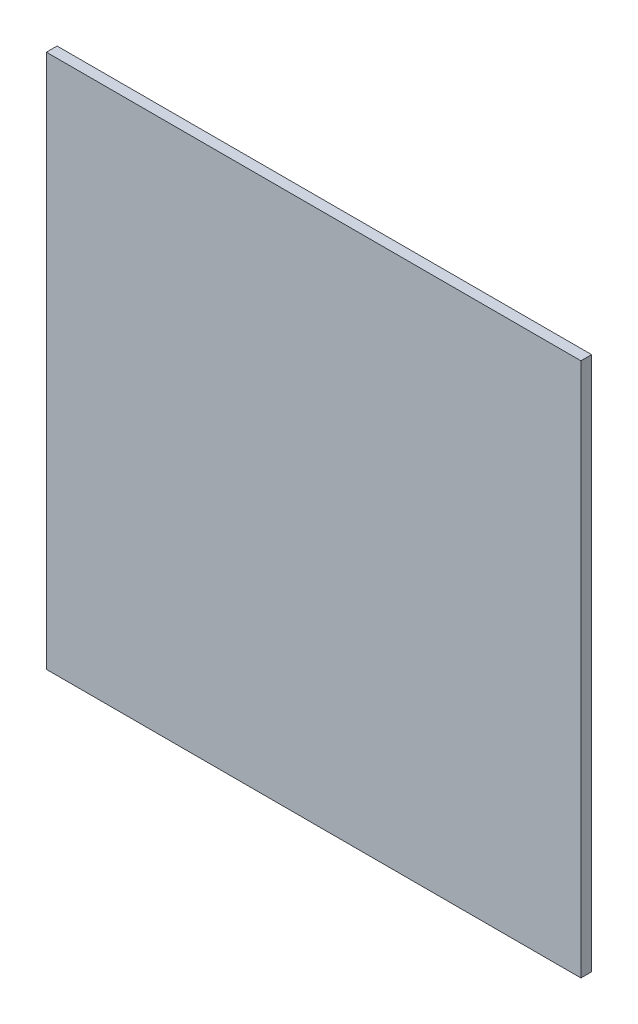
ISO-10303-21;
HEADER;
FILE_DESCRIPTION(('STEP AP214'),'2;1');
FILE_NAME('part.step','',(''),(''),'','','');
FILE_SCHEMA(('AUTOMOTIVE_DESIGN { 1 0 10303 214 1 1 1 1 }'));
ENDSEC;
DATA;
#1=APPLICATION_CONTEXT('core data for automotive mechanical design processes');
#2=APPLICATION_PROTOCOL_DEFINITION('international standard','automotive_design',2000,#1);
#3=PRODUCT_CONTEXT('',#1,'mechanical');
#4=PRODUCT('Part','Part','',(#3));
#5=PRODUCT_RELATED_PRODUCT_CATEGORY('part','',(#4));
#6=PRODUCT_DEFINITION_FORMATION('','',#4);
#7=PRODUCT_DEFINITION_CONTEXT('part definition',#1,'design');
#8=PRODUCT_DEFINITION('design','',#6,#7);
#9=PRODUCT_DEFINITION_SHAPE('','',#8);
#10=(LENGTH_UNIT() NAMED_UNIT(*) SI_UNIT(.MILLI.,.METRE.));
#11=(NAMED_UNIT(*) PLANE_ANGLE_UNIT() SI_UNIT($,.RADIAN.));
#12=(NAMED_UNIT(*) SI_UNIT($,.STERADIAN.) SOLID_ANGLE_UNIT());
#13=UNCERTAINTY_MEASURE_WITH_UNIT(LENGTH_MEASURE(1.E-05),#10,'distance_accuracy_value','');
#14=(GEOMETRIC_REPRESENTATION_CONTEXT(3) GLOBAL_UNCERTAINTY_ASSIGNED_CONTEXT((#13)) GLOBAL_UNIT_ASSIGNED_CONTEXT((#10,
#11,#12)) REPRESENTATION_CONTEXT('',''));
#15=CARTESIAN_POINT('',(0.,0.,0.));
#16=DIRECTION('',(0.,0.,1.));
#17=DIRECTION('',(1.,0.,0.));
#18=AXIS2_PLACEMENT_3D('',#15,#16,#17);
#19=CARTESIAN_POINT('',(0.,0.,1.));
#20=DIRECTION('',(1.,0.,0.));
#21=DIRECTION('',(0.,0.,-1.));
#22=AXIS2_PLACEMENT_3D('',#19,#20,#21);
#23=PLANE('',#22);
#24=DIRECTION('',(0.,-1.,0.));
#25=VECTOR('',#24,1.);
#26=CARTESIAN_POINT('',(0.,0.,0.));
#27=LINE('',#26,#25);
#28=CARTESIAN_POINT('',(0.,50.,0.));
#29=VERTEX_POINT('',#28);
#30=CARTESIAN_POINT('',(0.,0.,0.));
#31=VERTEX_POINT('',#30);
#32=EDGE_CURVE('E109',#29,#31,#27,.T.);
#33=ORIENTED_EDGE('',*,*,#32,.T.);
#34=DIRECTION('',(0.,0.,-1.));
#35=VECTOR('',#34,1.);
#36=CARTESIAN_POINT('',(0.,0.,1.));
#37=LINE('',#36,#35);
#38=CARTESIAN_POINT('',(0.,0.,1.));
#39=VERTEX_POINT('',#38);
#40=EDGE_CURVE('E11',#39,#31,#37,.T.);
#41=ORIENTED_EDGE('',*,*,#40,.F.);
#42=DIRECTION('',(0.,-1.,0.));
#43=VECTOR('',#42,1.);
#44=CARTESIAN_POINT('',(0.,0.,1.));
#45=LINE('',#44,#43);
#46=CARTESIAN_POINT('',(0.,50.,1.));
#47=VERTEX_POINT('',#46);
#48=EDGE_CURVE('E93',#47,#39,#45,.T.);
#49=ORIENTED_EDGE('',*,*,#48,.F.);
#50=DIRECTION('',(0.,0.,-1.));
#51=VECTOR('',#50,1.);
#52=CARTESIAN_POINT('',(0.,50.,1.));
#53=LINE('',#52,#51);
#54=EDGE_CURVE('E105',#47,#29,#53,.T.);
#55=ORIENTED_EDGE('',*,*,#54,.T.);
#56=EDGE_LOOP('',(#33,#41,#49,#55));
#57=FACE_BOUND('',#56,.T.);
#58=ADVANCED_FACE('F41',(#57),#23,.F.);
#59=CARTESIAN_POINT('',(0.,0.,1.));
#60=DIRECTION('',(0.,1.,0.));
#61=DIRECTION('',(0.,0.,1.));
#62=AXIS2_PLACEMENT_3D('',#59,#60,#61);
#63=PLANE('',#62);
#64=DIRECTION('',(1.,0.,0.));
#65=VECTOR('',#64,1.);
#66=CARTESIAN_POINT('',(0.,0.,0.));
#67=LINE('',#66,#65);
#68=CARTESIAN_POINT('',(50.,0.,0.));
#69=VERTEX_POINT('',#68);
#70=EDGE_CURVE('E98',#31,#69,#67,.T.);
#71=ORIENTED_EDGE('',*,*,#70,.T.);
#72=DIRECTION('',(0.,0.,-1.));
#73=VECTOR('',#72,1.);
#74=CARTESIAN_POINT('',(50.,0.,1.));
#75=LINE('',#74,#73);
#76=CARTESIAN_POINT('',(50.,0.,1.));
#77=VERTEX_POINT('',#76);
#78=EDGE_CURVE('E50',#77,#69,#75,.T.);
#79=ORIENTED_EDGE('',*,*,#78,.F.);
#80=DIRECTION('',(1.,0.,0.));
#81=VECTOR('',#80,1.);
#82=CARTESIAN_POINT('',(0.,0.,1.));
#83=LINE('',#82,#81);
#84=EDGE_CURVE('E88',#39,#77,#83,.T.);
#85=ORIENTED_EDGE('',*,*,#84,.F.);
#86=ORIENTED_EDGE('',*,*,#40,.T.);
#87=EDGE_LOOP('',(#71,#79,#85,#86));
#88=FACE_BOUND('',#87,.T.);
#89=ADVANCED_FACE('F97',(#88),#63,.F.);
#90=CARTESIAN_POINT('',(50.,0.,1.));
#91=DIRECTION('',(-1.,0.,0.));
#92=DIRECTION('',(0.,0.,1.));
#93=AXIS2_PLACEMENT_3D('',#90,#91,#92);
#94=PLANE('',#93);
#95=DIRECTION('',(0.,1.,0.));
#96=VECTOR('',#95,1.);
#97=CARTESIAN_POINT('',(50.,0.,0.));
#98=LINE('',#97,#96);
#99=CARTESIAN_POINT('',(50.,50.,0.));
#100=VERTEX_POINT('',#99);
#101=EDGE_CURVE('E75',#69,#100,#98,.T.);
#102=ORIENTED_EDGE('',*,*,#101,.T.);
#103=DIRECTION('',(0.,0.,-1.));
#104=VECTOR('',#103,1.);
#105=CARTESIAN_POINT('',(50.,50.,1.));
#106=LINE('',#105,#104);
#107=CARTESIAN_POINT('',(50.,50.,1.));
#108=VERTEX_POINT('',#107);
#109=EDGE_CURVE('E100',#108,#100,#106,.T.);
#110=ORIENTED_EDGE('',*,*,#109,.F.);
#111=DIRECTION('',(0.,1.,0.));
#112=VECTOR('',#111,1.);
#113=CARTESIAN_POINT('',(50.,0.,1.));
#114=LINE('',#113,#112);
#115=EDGE_CURVE('E91',#77,#108,#114,.T.);
#116=ORIENTED_EDGE('',*,*,#115,.F.);
#117=ORIENTED_EDGE('',*,*,#78,.T.);
#118=EDGE_LOOP('',(#102,#110,#116,#117));
#119=FACE_BOUND('',#118,.T.);
#120=ADVANCED_FACE('F101',(#119),#94,.F.);
#121=CARTESIAN_POINT('',(0.,50.,1.));
#122=DIRECTION('',(0.,-1.,0.));
#123=DIRECTION('',(0.,0.,-1.));
#124=AXIS2_PLACEMENT_3D('',#121,#122,#123);
#125=PLANE('',#124);
#126=DIRECTION('',(-1.,0.,0.));
#127=VECTOR('',#126,1.);
#128=CARTESIAN_POINT('',(0.,50.,0.));
#129=LINE('',#128,#127);
#130=EDGE_CURVE('E81',#100,#29,#129,.T.);
#131=ORIENTED_EDGE('',*,*,#130,.T.);
#132=ORIENTED_EDGE('',*,*,#54,.F.);
#133=DIRECTION('',(-1.,0.,0.));
#134=VECTOR('',#133,1.);
#135=CARTESIAN_POINT('',(0.,50.,1.));
#136=LINE('',#135,#134);
#137=EDGE_CURVE('E58',#108,#47,#136,.T.);
#138=ORIENTED_EDGE('',*,*,#137,.F.);
#139=ORIENTED_EDGE('',*,*,#109,.T.);
#140=EDGE_LOOP('',(#131,#132,#138,#139));
#141=FACE_BOUND('',#140,.T.);
#142=ADVANCED_FACE('F122',(#141),#125,.F.);
#143=CARTESIAN_POINT('',(0.,0.,1.));
#144=DIRECTION('',(0.,0.,-1.));
#145=DIRECTION('',(-1.,0.,0.));
#146=AXIS2_PLACEMENT_3D('',#143,#144,#145);
#147=PLANE('',#146);
#148=ORIENTED_EDGE('',*,*,#48,.T.);
#149=ORIENTED_EDGE('',*,*,#84,.T.);
#150=ORIENTED_EDGE('',*,*,#115,.T.);
#151=ORIENTED_EDGE('',*,*,#137,.T.);
#152=EDGE_LOOP('',(#148,#149,#150,#151));
#153=FACE_BOUND('',#152,.T.);
#154=ADVANCED_FACE('F89',(#153),#147,.F.);
#155=CARTESIAN_POINT('',(0.,0.,0.));
#156=DIRECTION('',(0.,0.,-1.));
#157=DIRECTION('',(-1.,0.,0.));
#158=AXIS2_PLACEMENT_3D('',#155,#156,#157);
#159=PLANE('',#158);
#160=ORIENTED_EDGE('',*,*,#32,.F.);
#161=ORIENTED_EDGE('',*,*,#130,.F.);
#162=ORIENTED_EDGE('',*,*,#101,.F.);
#163=ORIENTED_EDGE('',*,*,#70,.F.);
#164=EDGE_LOOP('',(#160,#161,#162,#163));
#165=FACE_BOUND('',#164,.T.);
#166=ADVANCED_FACE('F125',(#165),#159,.T.);
#167=CLOSED_SHELL('',(#58,#89,#120,#142,#154,#166));
#168=MANIFOLD_SOLID_BREP('B2',#167);
#169=ADVANCED_BREP_SHAPE_REPRESENTATION('',(#18,#168),#14);
#170=SHAPE_DEFINITION_REPRESENTATION(#9,#169);
ENDSEC;
END-ISO-10303-21;
